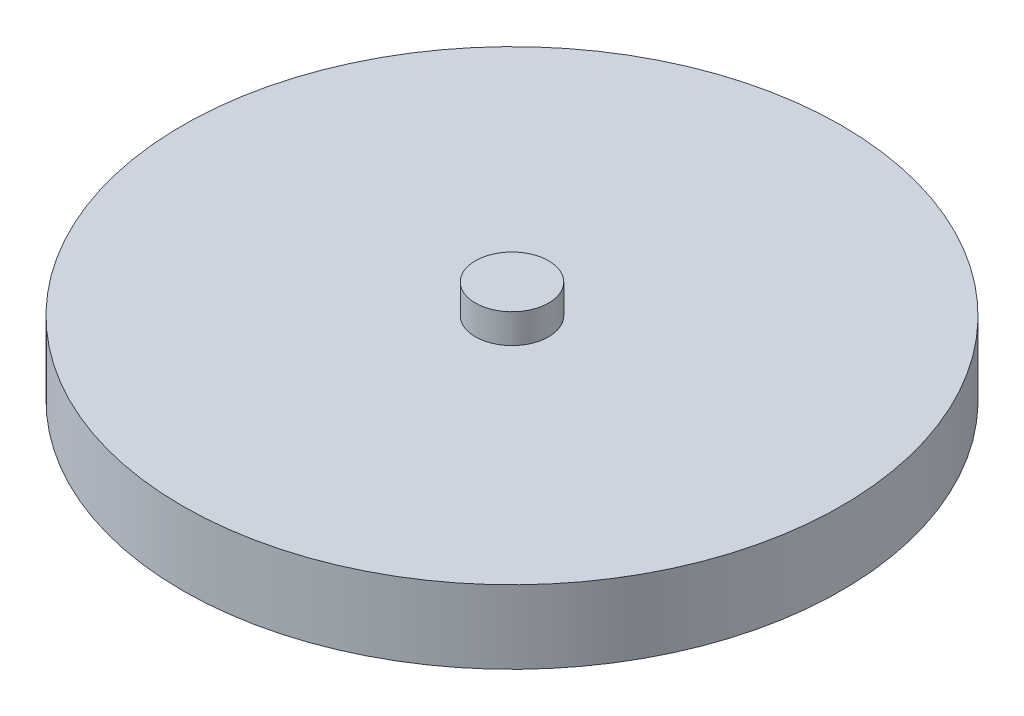
ISO-10303-21;
HEADER;
FILE_DESCRIPTION(('STEP AP214'),'2;1');
FILE_NAME('part.step','',(''),(''),'','','');
FILE_SCHEMA(('AUTOMOTIVE_DESIGN { 1 0 10303 214 1 1 1 1 }'));
ENDSEC;
DATA;
#1=APPLICATION_CONTEXT('core data for automotive mechanical design processes');
#2=APPLICATION_PROTOCOL_DEFINITION('international standard','automotive_design',2000,#1);
#3=PRODUCT_CONTEXT('',#1,'mechanical');
#4=PRODUCT('Part','Part','',(#3));
#5=PRODUCT_RELATED_PRODUCT_CATEGORY('part','',(#4));
#6=PRODUCT_DEFINITION_FORMATION('','',#4);
#7=PRODUCT_DEFINITION_CONTEXT('part definition',#1,'design');
#8=PRODUCT_DEFINITION('design','',#6,#7);
#9=PRODUCT_DEFINITION_SHAPE('','',#8);
#10=(LENGTH_UNIT() NAMED_UNIT(*) SI_UNIT(.MILLI.,.METRE.));
#11=(NAMED_UNIT(*) PLANE_ANGLE_UNIT() SI_UNIT($,.RADIAN.));
#12=(NAMED_UNIT(*) SI_UNIT($,.STERADIAN.) SOLID_ANGLE_UNIT());
#13=UNCERTAINTY_MEASURE_WITH_UNIT(LENGTH_MEASURE(1.E-05),#10,'distance_accuracy_value','');
#14=(GEOMETRIC_REPRESENTATION_CONTEXT(3) GLOBAL_UNCERTAINTY_ASSIGNED_CONTEXT((#13)) GLOBAL_UNIT_ASSIGNED_CONTEXT((#10,
#11,#12)) REPRESENTATION_CONTEXT('',''));
#15=CARTESIAN_POINT('',(0.,0.,0.));
#16=DIRECTION('',(0.,0.,1.));
#17=DIRECTION('',(1.,0.,0.));
#18=AXIS2_PLACEMENT_3D('',#15,#16,#17);
#19=CARTESIAN_POINT('',(0.,5.,0.));
#20=DIRECTION('',(0.,-1.,0.));
#21=DIRECTION('',(0.,0.,-1.));
#22=AXIS2_PLACEMENT_3D('',#19,#20,#21);
#23=CYLINDRICAL_SURFACE('',#22,22.5);
#24=CARTESIAN_POINT('',(0.,5.,0.));
#25=DIRECTION('',(0.,1.,0.));
#26=DIRECTION('',(0.,0.,1.));
#27=AXIS2_PLACEMENT_3D('',#24,#25,#26);
#28=CIRCLE('',#27,22.5);
#29=CARTESIAN_POINT('',(0.,5.,22.5));
#30=VERTEX_POINT('',#29);
#31=EDGE_CURVE('E10',#30,#30,#28,.T.);
#32=ORIENTED_EDGE('',*,*,#31,.F.);
#33=EDGE_LOOP('',(#32));
#34=FACE_BOUND('',#33,.T.);
#35=CARTESIAN_POINT('',(0.,0.,0.));
#36=DIRECTION('',(0.,1.,0.));
#37=DIRECTION('',(0.,0.,1.));
#38=AXIS2_PLACEMENT_3D('',#35,#36,#37);
#39=CIRCLE('',#38,22.5);
#40=CARTESIAN_POINT('',(0.,0.,22.5));
#41=VERTEX_POINT('',#40);
#42=EDGE_CURVE('E34',#41,#41,#39,.T.);
#43=ORIENTED_EDGE('',*,*,#42,.T.);
#44=EDGE_LOOP('',(#43));
#45=FACE_BOUND('',#44,.T.);
#46=ADVANCED_FACE('F31',(#34,#45),#23,.T.);
#47=CARTESIAN_POINT('',(0.,5.,0.));
#48=DIRECTION('',(0.,1.,0.));
#49=DIRECTION('',(0.,0.,1.));
#50=AXIS2_PLACEMENT_3D('',#47,#48,#49);
#51=PLANE('',#50);
#52=CARTESIAN_POINT('',(0.,5.,0.));
#53=DIRECTION('',(0.,1.,0.));
#54=DIRECTION('',(0.,0.,1.));
#55=AXIS2_PLACEMENT_3D('',#52,#53,#54);
#56=CIRCLE('',#55,2.5);
#57=CARTESIAN_POINT('',(0.,5.,2.5));
#58=VERTEX_POINT('',#57);
#59=EDGE_CURVE('E43',#58,#58,#56,.T.);
#60=ORIENTED_EDGE('',*,*,#59,.F.);
#61=EDGE_LOOP('',(#60));
#62=FACE_BOUND('',#61,.T.);
#63=ORIENTED_EDGE('',*,*,#31,.T.);
#64=EDGE_LOOP('',(#63));
#65=FACE_BOUND('',#64,.T.);
#66=ADVANCED_FACE('F58',(#62,#65),#51,.T.);
#67=CARTESIAN_POINT('',(0.,0.,0.));
#68=DIRECTION('',(0.,1.,0.));
#69=DIRECTION('',(0.,0.,1.));
#70=AXIS2_PLACEMENT_3D('',#67,#68,#69);
#71=PLANE('',#70);
#72=ORIENTED_EDGE('',*,*,#42,.F.);
#73=EDGE_LOOP('',(#72));
#74=FACE_BOUND('',#73,.T.);
#75=ADVANCED_FACE('F54',(#74),#71,.F.);
#76=CARTESIAN_POINT('',(0.,7.,0.));
#77=DIRECTION('',(0.,-1.,0.));
#78=DIRECTION('',(0.,0.,-1.));
#79=AXIS2_PLACEMENT_3D('',#76,#77,#78);
#80=CYLINDRICAL_SURFACE('',#79,2.5);
#81=CARTESIAN_POINT('',(0.,7.,0.));
#82=DIRECTION('',(0.,1.,0.));
#83=DIRECTION('',(0.,0.,1.));
#84=AXIS2_PLACEMENT_3D('',#81,#82,#83);
#85=CIRCLE('',#84,2.5);
#86=CARTESIAN_POINT('',(0.,7.,2.5));
#87=VERTEX_POINT('',#86);
#88=EDGE_CURVE('E41',#87,#87,#85,.T.);
#89=ORIENTED_EDGE('',*,*,#88,.F.);
#90=EDGE_LOOP('',(#89));
#91=FACE_BOUND('',#90,.T.);
#92=ORIENTED_EDGE('',*,*,#59,.T.);
#93=EDGE_LOOP('',(#92));
#94=FACE_BOUND('',#93,.T.);
#95=ADVANCED_FACE('F51',(#91,#94),#80,.T.);
#96=CARTESIAN_POINT('',(0.,7.,0.));
#97=DIRECTION('',(0.,1.,0.));
#98=DIRECTION('',(0.,0.,1.));
#99=AXIS2_PLACEMENT_3D('',#96,#97,#98);
#100=PLANE('',#99);
#101=ORIENTED_EDGE('',*,*,#88,.T.);
#102=EDGE_LOOP('',(#101));
#103=FACE_BOUND('',#102,.T.);
#104=ADVANCED_FACE('F49',(#103),#100,.T.);
#105=CLOSED_SHELL('',(#46,#66,#75,#95,#104));
#106=MANIFOLD_SOLID_BREP('B2',#105);
#107=ADVANCED_BREP_SHAPE_REPRESENTATION('',(#18,#106),#14);
#108=SHAPE_DEFINITION_REPRESENTATION(#9,#107);
ENDSEC;
END-ISO-10303-21;
